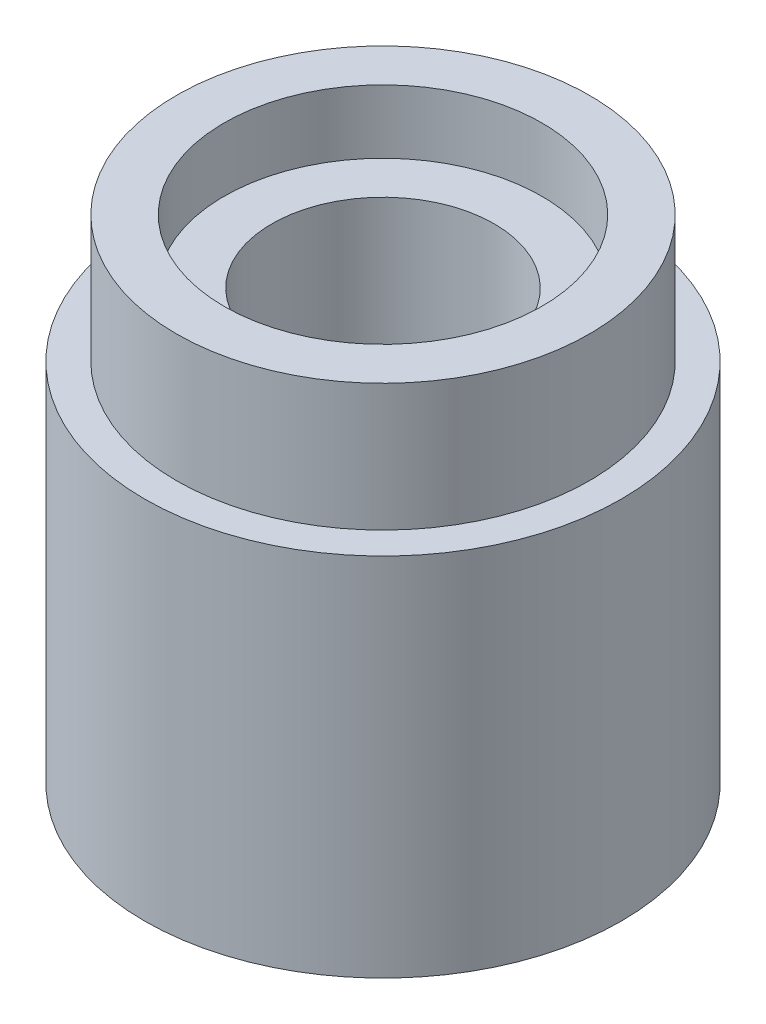
ISO-10303-21;
HEADER;
FILE_DESCRIPTION(('STEP AP214'),'2;1');
FILE_NAME('part.step','',(''),(''),'','','');
FILE_SCHEMA(('AUTOMOTIVE_DESIGN { 1 0 10303 214 1 1 1 1 }'));
ENDSEC;
DATA;
#1=APPLICATION_CONTEXT('core data for automotive mechanical design processes');
#2=APPLICATION_PROTOCOL_DEFINITION('international standard','automotive_design',2000,#1);
#3=PRODUCT_CONTEXT('',#1,'mechanical');
#4=PRODUCT('Part','Part','',(#3));
#5=PRODUCT_RELATED_PRODUCT_CATEGORY('part','',(#4));
#6=PRODUCT_DEFINITION_FORMATION('','',#4);
#7=PRODUCT_DEFINITION_CONTEXT('part definition',#1,'design');
#8=PRODUCT_DEFINITION('design','',#6,#7);
#9=PRODUCT_DEFINITION_SHAPE('','',#8);
#10=(LENGTH_UNIT() NAMED_UNIT(*) SI_UNIT(.MILLI.,.METRE.));
#11=(NAMED_UNIT(*) PLANE_ANGLE_UNIT() SI_UNIT($,.RADIAN.));
#12=(NAMED_UNIT(*) SI_UNIT($,.STERADIAN.) SOLID_ANGLE_UNIT());
#13=UNCERTAINTY_MEASURE_WITH_UNIT(LENGTH_MEASURE(1.E-05),#10,'distance_accuracy_value','');
#14=(GEOMETRIC_REPRESENTATION_CONTEXT(3) GLOBAL_UNCERTAINTY_ASSIGNED_CONTEXT((#13)) GLOBAL_UNIT_ASSIGNED_CONTEXT((#10,
#11,#12)) REPRESENTATION_CONTEXT('',''));
#15=CARTESIAN_POINT('',(0.,0.,0.));
#16=DIRECTION('',(0.,0.,1.));
#17=DIRECTION('',(1.,0.,0.));
#18=AXIS2_PLACEMENT_3D('',#15,#16,#17);
#19=CARTESIAN_POINT('',(0.,7.75,0.));
#20=DIRECTION('',(0.,-1.,0.));
#21=DIRECTION('',(0.,0.,-1.));
#22=AXIS2_PLACEMENT_3D('',#19,#20,#21);
#23=CYLINDRICAL_SURFACE('',#22,3.75);
#24=CARTESIAN_POINT('',(0.,0.,0.));
#25=DIRECTION('',(0.,1.,0.));
#26=DIRECTION('',(0.,0.,1.));
#27=AXIS2_PLACEMENT_3D('',#24,#25,#26);
#28=CIRCLE('',#27,3.75);
#29=CARTESIAN_POINT('',(0.,0.,3.75));
#30=VERTEX_POINT('',#29);
#31=EDGE_CURVE('E10',#30,#30,#28,.T.);
#32=ORIENTED_EDGE('',*,*,#31,.T.);
#33=EDGE_LOOP('',(#32));
#34=FACE_BOUND('',#33,.T.);
#35=CARTESIAN_POINT('',(0.,5.75,0.));
#36=DIRECTION('',(0.,1.,0.));
#37=DIRECTION('',(0.,0.,1.));
#38=AXIS2_PLACEMENT_3D('',#35,#36,#37);
#39=CIRCLE('',#38,3.75);
#40=CARTESIAN_POINT('',(0.,5.75,3.75));
#41=VERTEX_POINT('',#40);
#42=EDGE_CURVE('E44',#41,#41,#39,.T.);
#43=ORIENTED_EDGE('',*,*,#42,.F.);
#44=EDGE_LOOP('',(#43));
#45=FACE_BOUND('',#44,.T.);
#46=ADVANCED_FACE('F36',(#34,#45),#23,.T.);
#47=CARTESIAN_POINT('',(0.,0.,0.));
#48=DIRECTION('',(0.,1.,0.));
#49=DIRECTION('',(0.,0.,1.));
#50=AXIS2_PLACEMENT_3D('',#47,#48,#49);
#51=PLANE('',#50);
#52=ORIENTED_EDGE('',*,*,#31,.F.);
#53=EDGE_LOOP('',(#52));
#54=FACE_BOUND('',#53,.T.);
#55=ADVANCED_FACE('F92',(#54),#51,.F.);
#56=CARTESIAN_POINT('',(0.,5.75,0.));
#57=DIRECTION('',(0.,1.,0.));
#58=DIRECTION('',(0.,0.,1.));
#59=AXIS2_PLACEMENT_3D('',#56,#57,#58);
#60=PLANE('',#59);
#61=CARTESIAN_POINT('',(0.,5.75,0.));
#62=DIRECTION('',(0.,1.,0.));
#63=DIRECTION('',(0.,0.,1.));
#64=AXIS2_PLACEMENT_3D('',#61,#62,#63);
#65=CIRCLE('',#64,3.25);
#66=CARTESIAN_POINT('',(0.,5.75,3.25));
#67=VERTEX_POINT('',#66);
#68=EDGE_CURVE('E49',#67,#67,#65,.T.);
#69=ORIENTED_EDGE('',*,*,#68,.F.);
#70=EDGE_LOOP('',(#69));
#71=FACE_BOUND('',#70,.T.);
#72=ORIENTED_EDGE('',*,*,#42,.T.);
#73=EDGE_LOOP('',(#72));
#74=FACE_BOUND('',#73,.T.);
#75=ADVANCED_FACE('F96',(#71,#74),#60,.T.);
#76=CARTESIAN_POINT('',(0.,5.75,0.));
#77=DIRECTION('',(0.,1.,0.));
#78=DIRECTION('',(0.,0.,1.));
#79=AXIS2_PLACEMENT_3D('',#76,#77,#78);
#80=CYLINDRICAL_SURFACE('',#79,3.25);
#81=ORIENTED_EDGE('',*,*,#68,.T.);
#82=EDGE_LOOP('',(#81));
#83=FACE_BOUND('',#82,.T.);
#84=CARTESIAN_POINT('',(0.,7.75,0.));
#85=DIRECTION('',(0.,1.,0.));
#86=DIRECTION('',(0.,0.,1.));
#87=AXIS2_PLACEMENT_3D('',#84,#85,#86);
#88=CIRCLE('',#87,3.25);
#89=CARTESIAN_POINT('',(0.,7.75,3.25));
#90=VERTEX_POINT('',#89);
#91=EDGE_CURVE('E52',#90,#90,#88,.T.);
#92=ORIENTED_EDGE('',*,*,#91,.F.);
#93=EDGE_LOOP('',(#92));
#94=FACE_BOUND('',#93,.T.);
#95=ADVANCED_FACE('F102',(#83,#94),#80,.T.);
#96=CARTESIAN_POINT('',(0.,7.75,0.));
#97=DIRECTION('',(0.,1.,0.));
#98=DIRECTION('',(0.,0.,1.));
#99=AXIS2_PLACEMENT_3D('',#96,#97,#98);
#100=PLANE('',#99);
#101=CARTESIAN_POINT('',(0.,7.75,0.));
#102=DIRECTION('',(0.,1.,0.));
#103=DIRECTION('',(0.,0.,1.));
#104=AXIS2_PLACEMENT_3D('',#101,#102,#103);
#105=CIRCLE('',#104,2.5);
#106=CARTESIAN_POINT('',(0.,7.75,2.5));
#107=VERTEX_POINT('',#106);
#108=EDGE_CURVE('E63',#107,#107,#105,.T.);
#109=ORIENTED_EDGE('',*,*,#108,.F.);
#110=EDGE_LOOP('',(#109));
#111=FACE_BOUND('',#110,.T.);
#112=ORIENTED_EDGE('',*,*,#91,.T.);
#113=EDGE_LOOP('',(#112));
#114=FACE_BOUND('',#113,.T.);
#115=ADVANCED_FACE('F108',(#111,#114),#100,.T.);
#116=CARTESIAN_POINT('',(0.,6.75,0.));
#117=DIRECTION('',(0.,1.,0.));
#118=DIRECTION('',(0.,0.,1.));
#119=AXIS2_PLACEMENT_3D('',#116,#117,#118);
#120=PLANE('',#119);
#121=CARTESIAN_POINT('',(0.,6.75,0.));
#122=DIRECTION('',(0.,1.,0.));
#123=DIRECTION('',(0.,0.,1.));
#124=AXIS2_PLACEMENT_3D('',#121,#122,#123);
#125=CIRCLE('',#124,2.5);
#126=CARTESIAN_POINT('',(0.,6.75,2.5));
#127=VERTEX_POINT('',#126);
#128=EDGE_CURVE('E67',#127,#127,#125,.T.);
#129=ORIENTED_EDGE('',*,*,#128,.T.);
#130=EDGE_LOOP('',(#129));
#131=FACE_BOUND('',#130,.T.);
#132=CARTESIAN_POINT('',(0.,6.75,0.));
#133=DIRECTION('',(0.,1.,0.));
#134=DIRECTION('',(0.,0.,1.));
#135=AXIS2_PLACEMENT_3D('',#132,#133,#134);
#136=CIRCLE('',#135,1.75);
#137=CARTESIAN_POINT('',(0.,6.75,1.75));
#138=VERTEX_POINT('',#137);
#139=EDGE_CURVE('E39',#138,#138,#136,.F.);
#140=ORIENTED_EDGE('',*,*,#139,.T.);
#141=EDGE_LOOP('',(#140));
#142=FACE_BOUND('',#141,.T.);
#143=ADVANCED_FACE('F76',(#131,#142),#120,.T.);
#144=CARTESIAN_POINT('',(0.,6.75,0.));
#145=DIRECTION('',(0.,1.,0.));
#146=DIRECTION('',(0.,0.,1.));
#147=AXIS2_PLACEMENT_3D('',#144,#145,#146);
#148=CYLINDRICAL_SURFACE('',#147,2.5);
#149=ORIENTED_EDGE('',*,*,#128,.F.);
#150=EDGE_LOOP('',(#149));
#151=FACE_BOUND('',#150,.T.);
#152=ORIENTED_EDGE('',*,*,#108,.T.);
#153=EDGE_LOOP('',(#152));
#154=FACE_BOUND('',#153,.T.);
#155=ADVANCED_FACE('F86',(#151,#154),#148,.F.);
#156=CARTESIAN_POINT('',(0.,0.5,0.));
#157=DIRECTION('',(0.,1.,0.));
#158=DIRECTION('',(0.,0.,1.));
#159=AXIS2_PLACEMENT_3D('',#156,#157,#158);
#160=PLANE('',#159);
#161=CARTESIAN_POINT('',(0.,0.5,0.));
#162=DIRECTION('',(0.,1.,0.));
#163=DIRECTION('',(0.,0.,1.));
#164=AXIS2_PLACEMENT_3D('',#161,#162,#163);
#165=CIRCLE('',#164,1.75);
#166=CARTESIAN_POINT('',(0.,0.5,1.75));
#167=VERTEX_POINT('',#166);
#168=EDGE_CURVE('E56',#167,#167,#165,.T.);
#169=ORIENTED_EDGE('',*,*,#168,.T.);
#170=EDGE_LOOP('',(#169));
#171=FACE_BOUND('',#170,.T.);
#172=ADVANCED_FACE('F80',(#171),#160,.T.);
#173=CARTESIAN_POINT('',(0.,0.5,0.));
#174=DIRECTION('',(0.,1.,0.));
#175=DIRECTION('',(0.,0.,1.));
#176=AXIS2_PLACEMENT_3D('',#173,#174,#175);
#177=CYLINDRICAL_SURFACE('',#176,1.75);
#178=ORIENTED_EDGE('',*,*,#168,.F.);
#179=EDGE_LOOP('',(#178));
#180=FACE_BOUND('',#179,.T.);
#181=ORIENTED_EDGE('',*,*,#139,.F.);
#182=EDGE_LOOP('',(#181));
#183=FACE_BOUND('',#182,.T.);
#184=ADVANCED_FACE('F78',(#180,#183),#177,.F.);
#185=CLOSED_SHELL('',(#46,#55,#75,#95,#115,#143,#155,#172,#184));
#186=MANIFOLD_SOLID_BREP('B2',#185);
#187=ADVANCED_BREP_SHAPE_REPRESENTATION('',(#18,#186),#14);
#188=SHAPE_DEFINITION_REPRESENTATION(#9,#187);
ENDSEC;
END-ISO-10303-21;
